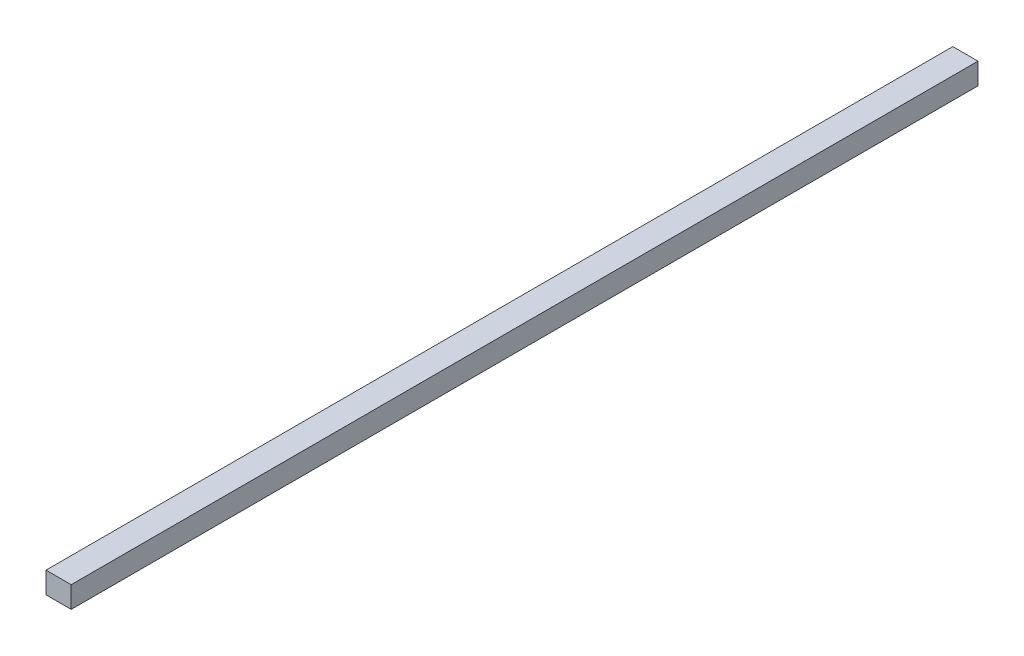
ISO-10303-21;
HEADER;
FILE_DESCRIPTION(('STEP AP214'),'2;1');
FILE_NAME('part.step','',(''),(''),'','','');
FILE_SCHEMA(('AUTOMOTIVE_DESIGN { 1 0 10303 214 1 1 1 1 }'));
ENDSEC;
DATA;
#1=APPLICATION_CONTEXT('core data for automotive mechanical design processes');
#2=APPLICATION_PROTOCOL_DEFINITION('international standard','automotive_design',2000,#1);
#3=PRODUCT_CONTEXT('',#1,'mechanical');
#4=PRODUCT('Part','Part','',(#3));
#5=PRODUCT_RELATED_PRODUCT_CATEGORY('part','',(#4));
#6=PRODUCT_DEFINITION_FORMATION('','',#4);
#7=PRODUCT_DEFINITION_CONTEXT('part definition',#1,'design');
#8=PRODUCT_DEFINITION('design','',#6,#7);
#9=PRODUCT_DEFINITION_SHAPE('','',#8);
#10=(LENGTH_UNIT() NAMED_UNIT(*) SI_UNIT(.MILLI.,.METRE.));
#11=(NAMED_UNIT(*) PLANE_ANGLE_UNIT() SI_UNIT($,.RADIAN.));
#12=(NAMED_UNIT(*) SI_UNIT($,.STERADIAN.) SOLID_ANGLE_UNIT());
#13=UNCERTAINTY_MEASURE_WITH_UNIT(LENGTH_MEASURE(1.E-05),#10,'distance_accuracy_value','');
#14=(GEOMETRIC_REPRESENTATION_CONTEXT(3) GLOBAL_UNCERTAINTY_ASSIGNED_CONTEXT((#13)) GLOBAL_UNIT_ASSIGNED_CONTEXT((#10,
#11,#12)) REPRESENTATION_CONTEXT('',''));
#15=CARTESIAN_POINT('',(0.,0.,0.));
#16=DIRECTION('',(0.,0.,1.));
#17=DIRECTION('',(1.,0.,0.));
#18=AXIS2_PLACEMENT_3D('',#15,#16,#17);
#19=CARTESIAN_POINT('',(2.,12.8126200545282,62.5272444685834));
#20=DIRECTION('',(0.,0.,-1.));
#21=DIRECTION('',(-1.,0.,0.));
#22=AXIS2_PLACEMENT_3D('',#19,#20,#21);
#23=PLANE('',#22);
#24=DIRECTION('',(0.,-1.,0.));
#25=VECTOR('',#24,1.);
#26=CARTESIAN_POINT('',(0.,12.8126200545282,62.5272444685834));
#27=LINE('',#26,#25);
#28=CARTESIAN_POINT('',(0.,12.8126200545282,62.5272444685834));
#29=VERTEX_POINT('',#28);
#30=CARTESIAN_POINT('',(0.,11.1126200545282,62.5272444685834));
#31=VERTEX_POINT('',#30);
#32=EDGE_CURVE('E94',#29,#31,#27,.T.);
#33=ORIENTED_EDGE('',*,*,#32,.T.);
#34=DIRECTION('',(-1.,0.,0.));
#35=VECTOR('',#34,1.);
#36=CARTESIAN_POINT('',(2.,11.1126200545282,62.5272444685834));
#37=LINE('',#36,#35);
#38=CARTESIAN_POINT('',(2.,11.1126200545282,62.5272444685834));
#39=VERTEX_POINT('',#38);
#40=EDGE_CURVE('E11',#39,#31,#37,.T.);
#41=ORIENTED_EDGE('',*,*,#40,.F.);
#42=DIRECTION('',(0.,-1.,0.));
#43=VECTOR('',#42,1.);
#44=CARTESIAN_POINT('',(2.,12.8126200545282,62.5272444685834));
#45=LINE('',#44,#43);
#46=CARTESIAN_POINT('',(2.,12.8126200545282,62.5272444685834));
#47=VERTEX_POINT('',#46);
#48=EDGE_CURVE('E82',#47,#39,#45,.T.);
#49=ORIENTED_EDGE('',*,*,#48,.F.);
#50=DIRECTION('',(-1.,0.,0.));
#51=VECTOR('',#50,1.);
#52=CARTESIAN_POINT('',(2.,12.8126200545282,62.5272444685834));
#53=LINE('',#52,#51);
#54=EDGE_CURVE('E90',#47,#29,#53,.T.);
#55=ORIENTED_EDGE('',*,*,#54,.T.);
#56=EDGE_LOOP('',(#33,#41,#49,#55));
#57=FACE_BOUND('',#56,.T.);
#58=ADVANCED_FACE('F31',(#57),#23,.F.);
#59=CARTESIAN_POINT('',(2.,11.1126200545282,62.5272444685834));
#60=DIRECTION('',(0.,1.,0.));
#61=DIRECTION('',(0.,0.,1.));
#62=AXIS2_PLACEMENT_3D('',#59,#60,#61);
#63=PLANE('',#62);
#64=DIRECTION('',(0.,0.,-1.));
#65=VECTOR('',#64,1.);
#66=CARTESIAN_POINT('',(0.,11.1126200545282,62.5272444685834));
#67=LINE('',#66,#65);
#68=CARTESIAN_POINT('',(0.,11.1126200545282,-9.47275553141662));
#69=VERTEX_POINT('',#68);
#70=EDGE_CURVE('E86',#31,#69,#67,.T.);
#71=ORIENTED_EDGE('',*,*,#70,.T.);
#72=DIRECTION('',(-1.,0.,0.));
#73=VECTOR('',#72,1.);
#74=CARTESIAN_POINT('',(2.,11.1126200545282,-9.47275553141662));
#75=LINE('',#74,#73);
#76=CARTESIAN_POINT('',(2.,11.1126200545282,-9.47275553141662));
#77=VERTEX_POINT('',#76);
#78=EDGE_CURVE('E39',#77,#69,#75,.T.);
#79=ORIENTED_EDGE('',*,*,#78,.F.);
#80=DIRECTION('',(0.,0.,-1.));
#81=VECTOR('',#80,1.);
#82=CARTESIAN_POINT('',(2.,11.1126200545282,62.5272444685834));
#83=LINE('',#82,#81);
#84=EDGE_CURVE('E77',#39,#77,#83,.T.);
#85=ORIENTED_EDGE('',*,*,#84,.F.);
#86=ORIENTED_EDGE('',*,*,#40,.T.);
#87=EDGE_LOOP('',(#71,#79,#85,#86));
#88=FACE_BOUND('',#87,.T.);
#89=ADVANCED_FACE('F85',(#88),#63,.F.);
#90=CARTESIAN_POINT('',(2.,12.8126200545282,-9.47275553141662));
#91=DIRECTION('',(0.,0.,1.));
#92=DIRECTION('',(1.,0.,0.));
#93=AXIS2_PLACEMENT_3D('',#90,#91,#92);
#94=PLANE('',#93);
#95=DIRECTION('',(0.,1.,0.));
#96=VECTOR('',#95,1.);
#97=CARTESIAN_POINT('',(0.,12.8126200545282,-9.47275553141662));
#98=LINE('',#97,#96);
#99=CARTESIAN_POINT('',(0.,12.8126200545282,-9.47275553141662));
#100=VERTEX_POINT('',#99);
#101=EDGE_CURVE('E64',#69,#100,#98,.T.);
#102=ORIENTED_EDGE('',*,*,#101,.T.);
#103=DIRECTION('',(-1.,0.,0.));
#104=VECTOR('',#103,1.);
#105=CARTESIAN_POINT('',(2.,12.8126200545282,-9.47275553141662));
#106=LINE('',#105,#104);
#107=CARTESIAN_POINT('',(2.,12.8126200545282,-9.47275553141662));
#108=VERTEX_POINT('',#107);
#109=EDGE_CURVE('E87',#108,#100,#106,.T.);
#110=ORIENTED_EDGE('',*,*,#109,.F.);
#111=DIRECTION('',(0.,1.,0.));
#112=VECTOR('',#111,1.);
#113=CARTESIAN_POINT('',(2.,12.8126200545282,-9.47275553141662));
#114=LINE('',#113,#112);
#115=EDGE_CURVE('E80',#77,#108,#114,.T.);
#116=ORIENTED_EDGE('',*,*,#115,.F.);
#117=ORIENTED_EDGE('',*,*,#78,.T.);
#118=EDGE_LOOP('',(#102,#110,#116,#117));
#119=FACE_BOUND('',#118,.T.);
#120=ADVANCED_FACE('F88',(#119),#94,.F.);
#121=CARTESIAN_POINT('',(2.,12.8126200545282,62.5272444685834));
#122=DIRECTION('',(0.,-1.,0.));
#123=DIRECTION('',(0.,0.,-1.));
#124=AXIS2_PLACEMENT_3D('',#121,#122,#123);
#125=PLANE('',#124);
#126=DIRECTION('',(0.,0.,1.));
#127=VECTOR('',#126,1.);
#128=CARTESIAN_POINT('',(0.,12.8126200545282,62.5272444685834));
#129=LINE('',#128,#127);
#130=EDGE_CURVE('E70',#100,#29,#129,.T.);
#131=ORIENTED_EDGE('',*,*,#130,.T.);
#132=ORIENTED_EDGE('',*,*,#54,.F.);
#133=DIRECTION('',(0.,0.,1.));
#134=VECTOR('',#133,1.);
#135=CARTESIAN_POINT('',(2.,12.8126200545282,62.5272444685834));
#136=LINE('',#135,#134);
#137=EDGE_CURVE('E47',#108,#47,#136,.T.);
#138=ORIENTED_EDGE('',*,*,#137,.F.);
#139=ORIENTED_EDGE('',*,*,#109,.T.);
#140=EDGE_LOOP('',(#131,#132,#138,#139));
#141=FACE_BOUND('',#140,.T.);
#142=ADVANCED_FACE('F101',(#141),#125,.F.);
#143=CARTESIAN_POINT('',(2.,11.1126200545282,62.5272444685834));
#144=DIRECTION('',(1.,0.,0.));
#145=DIRECTION('',(0.,0.,-1.));
#146=AXIS2_PLACEMENT_3D('',#143,#144,#145);
#147=PLANE('',#146);
#148=ORIENTED_EDGE('',*,*,#48,.T.);
#149=ORIENTED_EDGE('',*,*,#84,.T.);
#150=ORIENTED_EDGE('',*,*,#115,.T.);
#151=ORIENTED_EDGE('',*,*,#137,.T.);
#152=EDGE_LOOP('',(#148,#149,#150,#151));
#153=FACE_BOUND('',#152,.T.);
#154=ADVANCED_FACE('F78',(#153),#147,.T.);
#155=CARTESIAN_POINT('',(0.,11.1126200545282,62.5272444685834));
#156=DIRECTION('',(1.,0.,0.));
#157=DIRECTION('',(0.,0.,-1.));
#158=AXIS2_PLACEMENT_3D('',#155,#156,#157);
#159=PLANE('',#158);
#160=ORIENTED_EDGE('',*,*,#32,.F.);
#161=ORIENTED_EDGE('',*,*,#130,.F.);
#162=ORIENTED_EDGE('',*,*,#101,.F.);
#163=ORIENTED_EDGE('',*,*,#70,.F.);
#164=EDGE_LOOP('',(#160,#161,#162,#163));
#165=FACE_BOUND('',#164,.T.);
#166=ADVANCED_FACE('F104',(#165),#159,.F.);
#167=CLOSED_SHELL('',(#58,#89,#120,#142,#154,#166));
#168=MANIFOLD_SOLID_BREP('B2',#167);
#169=ADVANCED_BREP_SHAPE_REPRESENTATION('',(#18,#168),#14);
#170=SHAPE_DEFINITION_REPRESENTATION(#9,#169);
ENDSEC;
END-ISO-10303-21;
